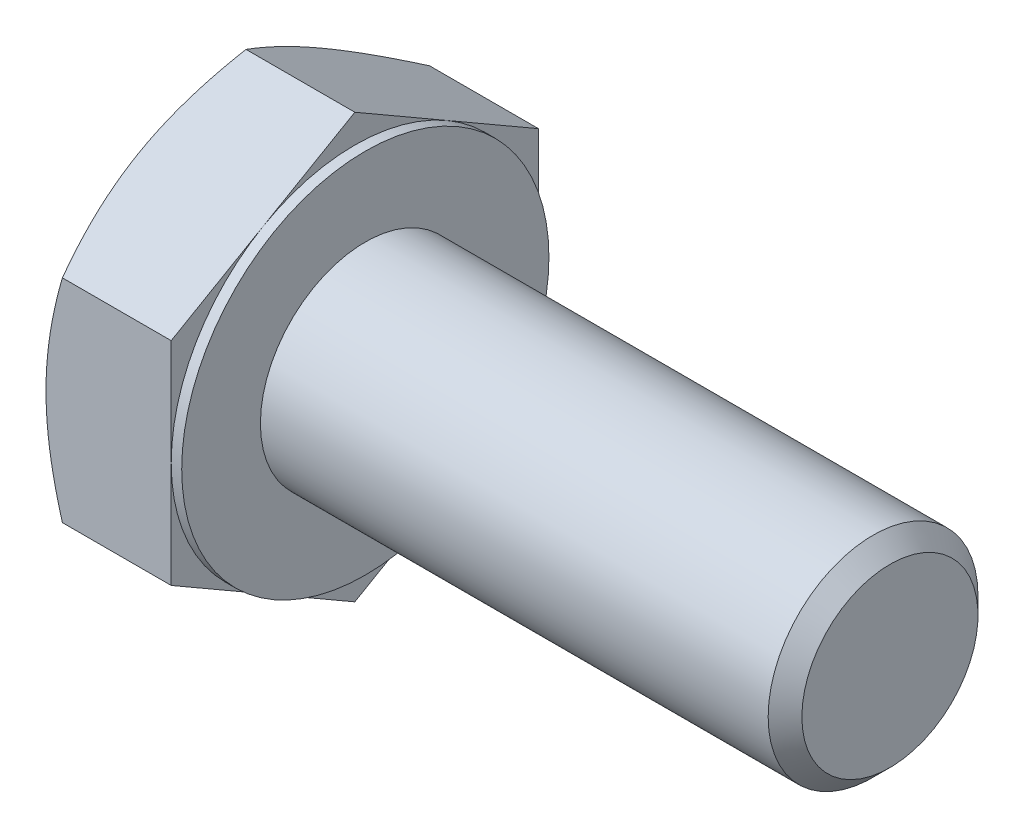
ISO-10303-21;
HEADER;
FILE_DESCRIPTION(('STEP AP214'),'2;1');
FILE_NAME('part.step','',(''),(''),'','','');
FILE_SCHEMA(('AUTOMOTIVE_DESIGN { 1 0 10303 214 1 1 1 1 }'));
ENDSEC;
DATA;
#1=APPLICATION_CONTEXT('core data for automotive mechanical design processes');
#2=APPLICATION_PROTOCOL_DEFINITION('international standard','automotive_design',2000,#1);
#3=PRODUCT_CONTEXT('',#1,'mechanical');
#4=PRODUCT('Part','Part','',(#3));
#5=PRODUCT_RELATED_PRODUCT_CATEGORY('part','',(#4));
#6=PRODUCT_DEFINITION_FORMATION('','',#4);
#7=PRODUCT_DEFINITION_CONTEXT('part definition',#1,'design');
#8=PRODUCT_DEFINITION('design','',#6,#7);
#9=PRODUCT_DEFINITION_SHAPE('','',#8);
#10=(LENGTH_UNIT() NAMED_UNIT(*) SI_UNIT(.MILLI.,.METRE.));
#11=(NAMED_UNIT(*) PLANE_ANGLE_UNIT() SI_UNIT($,.RADIAN.));
#12=(NAMED_UNIT(*) SI_UNIT($,.STERADIAN.) SOLID_ANGLE_UNIT());
#13=UNCERTAINTY_MEASURE_WITH_UNIT(LENGTH_MEASURE(1.E-05),#10,'distance_accuracy_value','');
#14=(GEOMETRIC_REPRESENTATION_CONTEXT(3) GLOBAL_UNCERTAINTY_ASSIGNED_CONTEXT((#13)) GLOBAL_UNIT_ASSIGNED_CONTEXT((#10,
#11,#12)) REPRESENTATION_CONTEXT('',''));
#15=CARTESIAN_POINT('',(0.,0.,0.));
#16=DIRECTION('',(0.,0.,1.));
#17=DIRECTION('',(1.,0.,0.));
#18=AXIS2_PLACEMENT_3D('',#15,#16,#17);
#19=CARTESIAN_POINT('',(7.76,12.1243556529821,0.));
#20=DIRECTION('',(1.,0.,0.));
#21=DIRECTION('',(0.,0.,-1.));
#22=AXIS2_PLACEMENT_3D('',#19,#20,#21);
#23=PLANE('',#22);
#24=CARTESIAN_POINT('',(7.76,0.,0.));
#25=DIRECTION('',(1.,0.,0.));
#26=DIRECTION('',(0.,0.,-1.));
#27=AXIS2_PLACEMENT_3D('',#24,#25,#26);
#28=CIRCLE('',#27,6.);
#29=CARTESIAN_POINT('',(7.76,0.,-6.));
#30=VERTEX_POINT('',#29);
#31=EDGE_CURVE('E289',#30,#30,#28,.F.);
#32=ORIENTED_EDGE('',*,*,#31,.T.);
#33=EDGE_LOOP('',(#32));
#34=FACE_BOUND('',#33,.T.);
#35=CARTESIAN_POINT('',(7.76,0.,0.));
#36=DIRECTION('',(1.,0.,0.));
#37=DIRECTION('',(0.,0.,-1.));
#38=AXIS2_PLACEMENT_3D('',#35,#36,#37);
#39=CIRCLE('',#38,10.5);
#40=CARTESIAN_POINT('',(7.76,0.,-10.5));
#41=VERTEX_POINT('',#40);
#42=EDGE_CURVE('E308',#41,#41,#39,.T.);
#43=ORIENTED_EDGE('',*,*,#42,.T.);
#44=EDGE_LOOP('',(#43));
#45=FACE_BOUND('',#44,.T.);
#46=ADVANCED_FACE('F43',(#34,#45),#23,.T.);
#47=CARTESIAN_POINT('',(0.,0.,0.));
#48=DIRECTION('',(-1.,0.,0.));
#49=DIRECTION('',(0.,0.,1.));
#50=AXIS2_PLACEMENT_3D('',#47,#48,#49);
#51=CYLINDRICAL_SURFACE('',#50,6.);
#52=ORIENTED_EDGE('',*,*,#31,.F.);
#53=EDGE_LOOP('',(#52));
#54=FACE_BOUND('',#53,.T.);
#55=CARTESIAN_POINT('',(36.796,0.,0.));
#56=DIRECTION('',(-1.,0.,0.));
#57=DIRECTION('',(0.,0.,1.));
#58=AXIS2_PLACEMENT_3D('',#55,#56,#57);
#59=CIRCLE('',#58,6.);
#60=CARTESIAN_POINT('',(36.796,0.,6.));
#61=VERTEX_POINT('',#60);
#62=EDGE_CURVE('E286',#61,#61,#59,.T.);
#63=ORIENTED_EDGE('',*,*,#62,.T.);
#64=EDGE_LOOP('',(#63));
#65=FACE_BOUND('',#64,.T.);
#66=ADVANCED_FACE('F258',(#54,#65),#51,.T.);
#67=CARTESIAN_POINT('',(37.76,0.,0.));
#68=DIRECTION('',(-1.,0.,0.));
#69=DIRECTION('',(0.,0.,1.));
#70=AXIS2_PLACEMENT_3D('',#67,#68,#69);
#71=CONICAL_SURFACE('',#70,5.036,0.785398163397442);
#72=ORIENTED_EDGE('',*,*,#62,.F.);
#73=EDGE_LOOP('',(#72));
#74=FACE_BOUND('',#73,.T.);
#75=CARTESIAN_POINT('',(37.76,0.,0.));
#76=DIRECTION('',(-1.,0.,0.));
#77=DIRECTION('',(0.,0.,1.));
#78=AXIS2_PLACEMENT_3D('',#75,#76,#77);
#79=CIRCLE('',#78,5.036);
#80=CARTESIAN_POINT('',(37.76,0.,5.036));
#81=VERTEX_POINT('',#80);
#82=EDGE_CURVE('E284',#81,#81,#79,.T.);
#83=ORIENTED_EDGE('',*,*,#82,.T.);
#84=EDGE_LOOP('',(#83));
#85=FACE_BOUND('',#84,.T.);
#86=ADVANCED_FACE('F265',(#74,#85),#71,.T.);
#87=CARTESIAN_POINT('',(37.76,0.,0.));
#88=DIRECTION('',(-1.,0.,0.));
#89=DIRECTION('',(0.,0.,1.));
#90=AXIS2_PLACEMENT_3D('',#87,#88,#89);
#91=PLANE('',#90);
#92=ORIENTED_EDGE('',*,*,#82,.F.);
#93=EDGE_LOOP('',(#92));
#94=FACE_BOUND('',#93,.T.);
#95=ADVANCED_FACE('F272',(#94),#91,.F.);
#96=CARTESIAN_POINT('',(7.16,10.5,0.));
#97=DIRECTION('',(1.,0.,0.));
#98=DIRECTION('',(0.,0.,-1.));
#99=AXIS2_PLACEMENT_3D('',#96,#97,#98);
#100=PLANE('',#99);
#101=DIRECTION('',(0.,0.500000000000001,0.866025403784438));
#102=VECTOR('',#101,1.);
#103=CARTESIAN_POINT('',(7.16,6.06217782649106,-10.5));
#104=LINE('',#103,#102);
#105=CARTESIAN_POINT('',(7.16,6.06217782649106,-10.5));
#106=VERTEX_POINT('',#105);
#107=CARTESIAN_POINT('',(7.16,9.0932667397366,-5.25000000000001));
#108=VERTEX_POINT('',#107);
#109=EDGE_CURVE('E176',#106,#108,#104,.T.);
#110=ORIENTED_EDGE('',*,*,#109,.T.);
#111=CARTESIAN_POINT('',(7.16,0.,0.));
#112=DIRECTION('',(-1.,0.,0.));
#113=DIRECTION('',(0.,0.,1.));
#114=AXIS2_PLACEMENT_3D('',#111,#112,#113);
#115=CIRCLE('',#114,10.5);
#116=CARTESIAN_POINT('',(7.16,0.,-10.5));
#117=VERTEX_POINT('',#116);
#118=EDGE_CURVE('E59',#108,#117,#115,.T.);
#119=ORIENTED_EDGE('',*,*,#118,.T.);
#120=DIRECTION('',(0.,1.,0.));
#121=VECTOR('',#120,1.);
#122=CARTESIAN_POINT('',(7.16,6.06217782649106,-10.5));
#123=LINE('',#122,#121);
#124=EDGE_CURVE('E48',#117,#106,#123,.T.);
#125=ORIENTED_EDGE('',*,*,#124,.T.);
#126=EDGE_LOOP('',(#110,#119,#125));
#127=FACE_BOUND('',#126,.T.);
#128=ADVANCED_FACE('F275',(#127),#100,.T.);
#129=CARTESIAN_POINT('',(7.16,12.1243556529821,0.));
#130=VERTEX_POINT('',#129);
#131=EDGE_CURVE('E174',#108,#130,#104,.T.);
#132=ORIENTED_EDGE('',*,*,#131,.T.);
#133=DIRECTION('',(0.,-0.500000000000001,0.866025403784438));
#134=VECTOR('',#133,1.);
#135=CARTESIAN_POINT('',(7.16,12.1243556529821,0.));
#136=LINE('',#135,#134);
#137=CARTESIAN_POINT('',(7.16,9.0932667397366,5.25000000000001));
#138=VERTEX_POINT('',#137);
#139=EDGE_CURVE('E173',#130,#138,#136,.T.);
#140=ORIENTED_EDGE('',*,*,#139,.T.);
#141=EDGE_CURVE('E162',#138,#108,#115,.T.);
#142=ORIENTED_EDGE('',*,*,#141,.T.);
#143=EDGE_LOOP('',(#132,#140,#142));
#144=FACE_BOUND('',#143,.T.);
#145=ADVANCED_FACE('F280',(#144),#100,.T.);
#146=CARTESIAN_POINT('',(7.16,6.06217782649106,10.5));
#147=VERTEX_POINT('',#146);
#148=EDGE_CURVE('E141',#138,#147,#136,.T.);
#149=ORIENTED_EDGE('',*,*,#148,.T.);
#150=DIRECTION('',(0.,-1.,0.));
#151=VECTOR('',#150,1.);
#152=CARTESIAN_POINT('',(7.16,6.06217782649106,10.5));
#153=LINE('',#152,#151);
#154=CARTESIAN_POINT('',(7.16,0.,10.5));
#155=VERTEX_POINT('',#154);
#156=EDGE_CURVE('E135',#147,#155,#153,.T.);
#157=ORIENTED_EDGE('',*,*,#156,.T.);
#158=EDGE_CURVE('E139',#155,#138,#115,.T.);
#159=ORIENTED_EDGE('',*,*,#158,.T.);
#160=EDGE_LOOP('',(#149,#157,#159));
#161=FACE_BOUND('',#160,.T.);
#162=ADVANCED_FACE('F137',(#161),#100,.T.);
#163=CARTESIAN_POINT('',(7.16,-6.06217782649105,10.5));
#164=VERTEX_POINT('',#163);
#165=EDGE_CURVE('E145',#155,#164,#153,.T.);
#166=ORIENTED_EDGE('',*,*,#165,.T.);
#167=DIRECTION('',(0.,-0.500000000000002,-0.866025403784438));
#168=VECTOR('',#167,1.);
#169=CARTESIAN_POINT('',(7.16,-12.1243556529822,0.));
#170=LINE('',#169,#168);
#171=CARTESIAN_POINT('',(7.16,-9.09326673973659,5.25000000000002));
#172=VERTEX_POINT('',#171);
#173=EDGE_CURVE('E152',#164,#172,#170,.T.);
#174=ORIENTED_EDGE('',*,*,#173,.T.);
#175=EDGE_CURVE('E149',#172,#155,#115,.T.);
#176=ORIENTED_EDGE('',*,*,#175,.T.);
#177=EDGE_LOOP('',(#166,#174,#176));
#178=FACE_BOUND('',#177,.T.);
#179=ADVANCED_FACE('F150',(#178),#100,.T.);
#180=CARTESIAN_POINT('',(7.16,-12.1243556529822,0.));
#181=VERTEX_POINT('',#180);
#182=EDGE_CURVE('E168',#172,#181,#170,.T.);
#183=ORIENTED_EDGE('',*,*,#182,.T.);
#184=DIRECTION('',(0.,0.5,-0.866025403784439));
#185=VECTOR('',#184,1.);
#186=CARTESIAN_POINT('',(7.16,-6.06217782649108,-10.5));
#187=LINE('',#186,#185);
#188=CARTESIAN_POINT('',(7.16,-9.09326673973661,-5.25));
#189=VERTEX_POINT('',#188);
#190=EDGE_CURVE('E344',#181,#189,#187,.T.);
#191=ORIENTED_EDGE('',*,*,#190,.T.);
#192=EDGE_CURVE('E156',#189,#172,#115,.T.);
#193=ORIENTED_EDGE('',*,*,#192,.T.);
#194=EDGE_LOOP('',(#183,#191,#193));
#195=FACE_BOUND('',#194,.T.);
#196=ADVANCED_FACE('F349',(#195),#100,.T.);
#197=CARTESIAN_POINT('',(7.16,-6.06217782649108,-10.5));
#198=VERTEX_POINT('',#197);
#199=EDGE_CURVE('E163',#189,#198,#187,.T.);
#200=ORIENTED_EDGE('',*,*,#199,.T.);
#201=EDGE_CURVE('E11',#198,#117,#123,.T.);
#202=ORIENTED_EDGE('',*,*,#201,.T.);
#203=EDGE_CURVE('E362',#117,#189,#115,.T.);
#204=ORIENTED_EDGE('',*,*,#203,.T.);
#205=EDGE_LOOP('',(#200,#202,#204));
#206=FACE_BOUND('',#205,.T.);
#207=ADVANCED_FACE('F281',(#206),#100,.T.);
#208=CARTESIAN_POINT('',(0.,0.,0.));
#209=DIRECTION('',(-1.,0.,0.));
#210=DIRECTION('',(0.,0.,1.));
#211=AXIS2_PLACEMENT_3D('',#208,#209,#210);
#212=CYLINDRICAL_SURFACE('',#211,10.5);
#213=ORIENTED_EDGE('',*,*,#118,.F.);
#214=ORIENTED_EDGE('',*,*,#141,.F.);
#215=ORIENTED_EDGE('',*,*,#158,.F.);
#216=ORIENTED_EDGE('',*,*,#175,.F.);
#217=ORIENTED_EDGE('',*,*,#192,.F.);
#218=ORIENTED_EDGE('',*,*,#203,.F.);
#219=EDGE_LOOP('',(#213,#214,#215,#216,#217,#218));
#220=FACE_BOUND('',#219,.T.);
#221=ORIENTED_EDGE('',*,*,#42,.F.);
#222=EDGE_LOOP('',(#221));
#223=FACE_BOUND('',#222,.T.);
#224=ADVANCED_FACE('F159',(#220,#223),#212,.T.);
#225=CARTESIAN_POINT('',(0.,12.1243556529821,0.));
#226=DIRECTION('',(1.,0.,0.));
#227=DIRECTION('',(0.,0.,-1.));
#228=AXIS2_PLACEMENT_3D('',#225,#226,#227);
#229=PLANE('',#228);
#230=CARTESIAN_POINT('',(0.,0.,0.));
#231=DIRECTION('',(1.,0.,0.));
#232=DIRECTION('',(0.,0.,-1.));
#233=AXIS2_PLACEMENT_3D('',#230,#231,#232);
#234=CIRCLE('',#233,10.5);
#235=CARTESIAN_POINT('',(0.,0.,-10.5));
#236=VERTEX_POINT('',#235);
#237=CARTESIAN_POINT('',(0.,9.0932667397366,-5.25000000000001));
#238=VERTEX_POINT('',#237);
#239=EDGE_CURVE('E307',#236,#238,#234,.T.);
#240=ORIENTED_EDGE('',*,*,#239,.F.);
#241=CARTESIAN_POINT('',(0.,-9.09326673973661,-5.25));
#242=VERTEX_POINT('',#241);
#243=EDGE_CURVE('E304',#242,#236,#234,.T.);
#244=ORIENTED_EDGE('',*,*,#243,.F.);
#245=CARTESIAN_POINT('',(0.,-9.09326673973659,5.25000000000002));
#246=VERTEX_POINT('',#245);
#247=EDGE_CURVE('E306',#246,#242,#234,.T.);
#248=ORIENTED_EDGE('',*,*,#247,.F.);
#249=CARTESIAN_POINT('',(0.,0.,10.5));
#250=VERTEX_POINT('',#249);
#251=EDGE_CURVE('E316',#250,#246,#234,.T.);
#252=ORIENTED_EDGE('',*,*,#251,.F.);
#253=CARTESIAN_POINT('',(0.,0.,0.));
#254=DIRECTION('',(-1.,0.,0.));
#255=DIRECTION('',(0.,0.,1.));
#256=AXIS2_PLACEMENT_3D('',#253,#254,#255);
#257=CIRCLE('',#256,10.5);
#258=CARTESIAN_POINT('',(0.,9.0932667397366,5.25000000000001));
#259=VERTEX_POINT('',#258);
#260=EDGE_CURVE('E177',#250,#259,#257,.T.);
#261=ORIENTED_EDGE('',*,*,#260,.T.);
#262=EDGE_CURVE('E311',#238,#259,#234,.T.);
#263=ORIENTED_EDGE('',*,*,#262,.F.);
#264=EDGE_LOOP('',(#240,#244,#248,#252,#261,#263));
#265=FACE_BOUND('',#264,.T.);
#266=ADVANCED_FACE('F208',(#265),#229,.F.);
#267=CARTESIAN_POINT('',(0.,0.,0.));
#268=DIRECTION('',(1.,0.,0.));
#269=DIRECTION('',(0.,0.,-1.));
#270=AXIS2_PLACEMENT_3D('',#267,#268,#269);
#271=CONICAL_SURFACE('',#270,10.5,1.0471975511966);
#272=CARTESIAN_POINT('',(0.93788884112796,6.06206235643723,10.5002));
#273=CARTESIAN_POINT('',(0.860963916074866,6.19532217726989,10.2693872197103));
#274=CARTESIAN_POINT('',(0.787530383052678,6.32907886020533,10.0377138490142));
#275=CARTESIAN_POINT('',(0.648614855969203,6.5976648546052,9.57250926051226));
#276=CARTESIAN_POINT('',(0.583135477152653,6.73249450340811,9.33897745841895));
#277=CARTESIAN_POINT('',(0.399895760205336,7.13915595713548,8.63461915908332));
#278=CARTESIAN_POINT('',(0.295669956057557,7.41259311049437,8.16101211678873));
#279=CARTESIAN_POINT('',(0.173455649415435,7.82177929100534,7.45228086238868));
#280=CARTESIAN_POINT('',(0.138641420005216,7.95630585259384,7.21927402274984));
#281=CARTESIAN_POINT('',(0.0802602632087865,8.22598182110483,6.75218154370847));
#282=CARTESIAN_POINT('',(0.056693552302522,8.36113123996485,6.51809588362951));
#283=CARTESIAN_POINT('',(0.0214112687997644,8.63165551188221,6.04953409998806));
#284=CARTESIAN_POINT('',(0.0096816130697718,8.76702990465438,5.81505877366288));
#285=CARTESIAN_POINT('',(-0.00167731742386591,9.03790372875115,5.3458915478868));
#286=CARTESIAN_POINT('',(-0.0013069660501828,9.17340315608311,5.11119965535135));
#287=CARTESIAN_POINT('',(0.0106922674925487,9.42672188157244,4.67243875229525));
#288=CARTESIAN_POINT('',(0.0208573916341302,9.54455906045898,4.46833877144319));
#289=CARTESIAN_POINT('',(0.0501416022118153,9.77995782117302,4.06061615784772));
#290=CARTESIAN_POINT('',(0.069261322025491,9.89751938291429,3.85699355989469));
#291=CARTESIAN_POINT('',(0.139600342172598,10.2497485423003,3.24691475993086));
#292=CARTESIAN_POINT('',(0.203790739708334,10.4837926714473,2.84153843703495));
#293=CARTESIAN_POINT('',(0.364267089688405,10.9543635439239,2.02648577734362));
#294=CARTESIAN_POINT('',(0.461233267874625,11.1908302333322,1.61691345699068));
#295=CARTESIAN_POINT('',(0.681306134882001,11.6602373627233,0.803876459450408));
#296=CARTESIAN_POINT('',(0.804361137283494,11.8931838134373,0.400401371370838));
#297=CARTESIAN_POINT('',(0.937888841127967,12.124471123036,-0.000200000000000229));
#298=B_SPLINE_CURVE_WITH_KNOTS('',3,(#272,#273,#274,#275,#276,#277,#278,#279,#280,#281,#282,
#283,#284,#285,#286,#287,#288,#289,#290,#291,#292,#293,#294,#295,#296,#297),.UNSPECIFIED.,.F.,
.F.,(4,2,2,2,2,2,2,2,2,2,2,2,4),(0.,0.832130250860041,1.66453336135423,3.33288308532808,
4.14658222524688,4.9602970257261,5.77304256378742,6.58576298988571,7.29326708484993,
8.00082123064117,9.41693497455991,10.864454487818,12.3091325775355),.UNSPECIFIED.);
#299=CARTESIAN_POINT('',(0.937822173508928,12.1243556529821,0.));
#300=VERTEX_POINT('',#299);
#301=EDGE_CURVE('E227',#259,#300,#298,.T.);
#302=ORIENTED_EDGE('',*,*,#301,.T.);
#303=CARTESIAN_POINT('',(0.937888841127967,12.124471123036,0.0002));
#304=CARTESIAN_POINT('',(0.860963916074872,11.9912113022033,-0.230612780289705));
#305=CARTESIAN_POINT('',(0.787530383052684,11.8574546192679,-0.462286150985754));
#306=CARTESIAN_POINT('',(0.648614855969208,11.588868624868,-0.927490739487739));
#307=CARTESIAN_POINT('',(0.583135477152658,11.4540389760651,-1.16102254158105));
#308=CARTESIAN_POINT('',(0.39989576020534,11.0473775223377,-1.86538084091668));
#309=CARTESIAN_POINT('',(0.295669956057561,10.7739403689788,-2.33898788321127));
#310=CARTESIAN_POINT('',(0.173455649415438,10.3647541884679,-3.04771913761133));
#311=CARTESIAN_POINT('',(0.138641420005218,10.2302276268794,-3.28072597725016));
#312=CARTESIAN_POINT('',(0.0802602632087872,9.96055165836838,-3.74781845629153));
#313=CARTESIAN_POINT('',(0.0566935523025218,9.82540223950836,-3.98190411637049));
#314=CARTESIAN_POINT('',(0.0214112687997641,9.554877967591,-4.45046590001194));
#315=CARTESIAN_POINT('',(0.00968161306977229,9.41950357481883,-4.68494122633712));
#316=CARTESIAN_POINT('',(-0.0016773174238659,9.14862975072206,-5.1541084521132));
#317=CARTESIAN_POINT('',(-0.00130696605018409,9.01313032339009,-5.38880034464865));
#318=CARTESIAN_POINT('',(0.010692267492547,8.75981159790077,-5.82756124770475));
#319=CARTESIAN_POINT('',(0.0208573916341292,8.64197441901423,-6.03166122855681));
#320=CARTESIAN_POINT('',(0.0501416022118143,8.40657565830019,-6.43938384215229));
#321=CARTESIAN_POINT('',(0.0692613220254892,8.28901409655892,-6.64300644010532));
#322=CARTESIAN_POINT('',(0.139600342172594,7.93678493717292,-7.25308524006914));
#323=CARTESIAN_POINT('',(0.20379073970833,7.70274080802586,-7.65846156296505));
#324=CARTESIAN_POINT('',(0.3642670896884,7.23216993554935,-8.47351422265637));
#325=CARTESIAN_POINT('',(0.461233267874619,6.99570324614096,-8.88308654300932));
#326=CARTESIAN_POINT('',(0.681306134881994,6.52629611674996,-9.69612354054959));
#327=CARTESIAN_POINT('',(0.804361137283486,6.29334966603591,-10.0995986286292));
#328=CARTESIAN_POINT('',(0.937888841127958,6.06206235643722,-10.5002));
#329=B_SPLINE_CURVE_WITH_KNOTS('',3,(#303,#304,#305,#306,#307,#308,#309,#310,#311,#312,#313,
#314,#315,#316,#317,#318,#319,#320,#321,#322,#323,#324,#325,#326,#327,#328),.UNSPECIFIED.,.F.,
.F.,(4,2,2,2,2,2,2,2,2,2,2,2,4),(0.,0.83213025086004,1.66453336135423,3.33288308532808,
4.14658222524689,4.96029702572611,5.77304256378742,6.58576298988572,7.29326708484994,
8.00082123064117,9.41693497455992,10.864454487818,12.3091325775355),.UNSPECIFIED.);
#330=EDGE_CURVE('E67',#300,#238,#329,.T.);
#331=ORIENTED_EDGE('',*,*,#330,.T.);
#332=ORIENTED_EDGE('',*,*,#262,.T.);
#333=EDGE_LOOP('',(#302,#331,#332));
#334=FACE_BOUND('',#333,.T.);
#335=ADVANCED_FACE('F358',(#334),#271,.T.);
#336=CARTESIAN_POINT('',(5.22047445997536,-16.4816482140568,10.5));
#337=CARTESIAN_POINT('',(5.10841571171519,-16.2515114735598,10.5));
#338=CARTESIAN_POINT('',(4.99690095530743,-16.0211099745561,10.5));
#339=CARTESIAN_POINT('',(4.77508224781972,-15.559722280235,10.5));
#340=CARTESIAN_POINT('',(4.6647783083252,-15.3287360793489,10.5));
#341=CARTESIAN_POINT('',(4.33583913312079,-14.6347588203258,10.5));
#342=CARTESIAN_POINT('',(4.11920831465378,-14.1708141864105,10.5));
#343=CARTESIAN_POINT('',(3.69144021647067,-13.2374542365562,10.5));
#344=CARTESIAN_POINT('',(3.4803375958213,-12.768022998992,10.5));
#345=CARTESIAN_POINT('',(3.06650722260727,-11.8254960891314,10.5));
#346=CARTESIAN_POINT('',(2.86377908729971,-11.3524005854809,10.5));
#347=CARTESIAN_POINT('',(2.46224554950905,-10.3857558923946,10.5));
#348=CARTESIAN_POINT('',(2.26380321740469,-9.89205511876752,10.5));
#349=CARTESIAN_POINT('',(1.8814629725383,-8.89894764184035,10.5));
#350=CARTESIAN_POINT('',(1.69756666425613,-8.39954031602049,10.5));
#351=CARTESIAN_POINT('',(1.34900485222961,-7.39511365326185,10.5));
#352=CARTESIAN_POINT('',(1.18430206101262,-6.89010735786107,10.5));
#353=CARTESIAN_POINT('',(0.879270894971035,-5.87280589755246,10.5));
#354=CARTESIAN_POINT('',(0.738935048658887,-5.36051301919645,10.5));
#355=CARTESIAN_POINT('',(0.552073744608598,-4.58793726300858,10.5));
#356=CARTESIAN_POINT('',(0.493860241162087,-4.33046551050763,10.5));
#357=CARTESIAN_POINT('',(0.385986916267515,-3.81372703405903,10.5));
#358=CARTESIAN_POINT('',(0.336326929050835,-3.55446034499886,10.5));
#359=CARTESIAN_POINT('',(0.246424565907479,-3.03429646607579,10.5));
#360=CARTESIAN_POINT('',(0.206181997423116,-2.77339930966301,10.5));
#361=CARTESIAN_POINT('',(0.135909252260438,-2.25023434858904,10.5));
#362=CARTESIAN_POINT('',(0.10587866333212,-1.98796659969175,10.5));
#363=CARTESIAN_POINT('',(0.0570143132377883,-1.46593685398522,10.5));
#364=CARTESIAN_POINT('',(0.0380355913859207,-1.20618851046129,10.5));
#365=CARTESIAN_POINT('',(0.011088652904134,-0.686121830920416,10.5));
#366=CARTESIAN_POINT('',(0.00312024799755506,-0.425803504726439,10.5));
#367=CARTESIAN_POINT('',(-0.00161548269340229,0.0949369886887055,10.5));
#368=CARTESIAN_POINT('',(0.0016171740722833,0.355359155747468,10.5));
#369=CARTESIAN_POINT('',(0.0192021822582614,0.87583052258273,10.5));
#370=CARTESIAN_POINT('',(0.0335550415989468,1.1358797047794,10.5));
#371=CARTESIAN_POINT('',(0.0806524760626045,1.75496707583262,10.5));
#372=CARTESIAN_POINT('',(0.118345532369852,2.1136373118209,10.5));
#373=CARTESIAN_POINT('',(0.212873234930084,2.8284272831381,10.5));
#374=CARTESIAN_POINT('',(0.269710320924681,3.18454668747495,10.5));
#375=CARTESIAN_POINT('',(0.465933295546488,4.24861014214034,10.5));
#376=CARTESIAN_POINT('',(0.630998761834299,4.95188760375778,10.5));
#377=CARTESIAN_POINT('',(0.918660194089468,6.00372345480016,10.5));
#378=CARTESIAN_POINT('',(1.02259898965263,6.35769943645641,10.5));
#379=CARTESIAN_POINT('',(1.24163072977518,7.06221736873326,10.5));
#380=CARTESIAN_POINT('',(1.35672375176118,7.41275929549788,10.5));
#381=CARTESIAN_POINT('',(1.59618779282069,8.11051221625826,10.5));
#382=CARTESIAN_POINT('',(1.72055601508113,8.45772417900516,10.5));
#383=CARTESIAN_POINT('',(1.97707156080398,9.14924773243467,10.5));
#384=CARTESIAN_POINT('',(2.10921876866479,9.49355936613148,10.5));
#385=CARTESIAN_POINT('',(2.44296998759923,10.3391184043911,10.5));
#386=CARTESIAN_POINT('',(2.64829832241361,10.8388935045485,10.5));
#387=CARTESIAN_POINT('',(3.06975629526236,11.8338834048329,10.5));
#388=CARTESIAN_POINT('',(3.28588675525598,12.3290978545235,10.5));
#389=CARTESIAN_POINT('',(3.72667156109685,13.3158710243329,10.5));
#390=CARTESIAN_POINT('',(3.95132823824253,13.8074287000047,10.5));
#391=CARTESIAN_POINT('',(4.40735039707026,14.787397422387,10.5));
#392=CARTESIAN_POINT('',(4.63871569859714,15.275808553166,10.5));
#393=CARTESIAN_POINT('',(5.10713604015688,16.2506551575346,10.5));
#394=CARTESIAN_POINT('',(5.34419794777524,16.7370873249548,10.5));
#395=CARTESIAN_POINT('',(5.82271335290612,17.7077867337536,10.5));
#396=CARTESIAN_POINT('',(6.06416687416916,18.1920539634064,10.5));
#397=CARTESIAN_POINT('',(6.55064006057609,19.1586956492924,10.5));
#398=CARTESIAN_POINT('',(6.79565915421552,19.6410703934622,10.5));
#399=CARTESIAN_POINT('',(7.28869163212712,20.6042880925481,10.5));
#400=CARTESIAN_POINT('',(7.53670502871591,21.0851310411532,10.5));
#401=CARTESIAN_POINT('',(8.23932373085847,22.4387066917319,10.5));
#402=CARTESIAN_POINT('',(8.69680932414608,23.309944158655,10.5));
#403=CARTESIAN_POINT('',(9.61789414324542,25.0492220911548,10.5));
#404=CARTESIAN_POINT('',(10.0814936344989,25.9172624158169,10.5));
#405=CARTESIAN_POINT('',(11.0120158407316,27.6483953506379,10.5));
#406=CARTESIAN_POINT('',(11.4789254491471,28.5114950107132,10.5));
#407=CARTESIAN_POINT('',(12.1819662737832,29.8046526006514,10.5));
#408=CARTESIAN_POINT('',(12.4167519504062,30.2354431241637,10.5));
#409=CARTESIAN_POINT('',(12.8871248069562,31.0965855728269,10.5));
#410=CARTESIAN_POINT('',(13.1227119856788,31.5269374986354,10.5));
#411=CARTESIAN_POINT('',(13.3586525810193,31.9570956307335,10.5));
#412=B_SPLINE_CURVE_WITH_KNOTS('',3,(#336,#337,#338,#339,#340,#341,#342,#343,#344,#345,#346,
#347,#348,#349,#350,#351,#352,#353,#354,#355,#356,#357,#358,#359,#360,#361,#362,#363,#364,#365,
#366,#367,#368,#369,#370,#371,#372,#373,#374,#375,#376,#377,#378,#379,#380,#381,#382,#383,#384,
#385,#386,#387,#388,#389,#390,#391,#392,#393,#394,#395,#396,#397,#398,#399,#400,#401,#402,#403,
#404,#405,#406,#407,#408,#409,#410,#411),.UNSPECIFIED.,.F.,.F.,(4,2,2,2,2,2,2,2,2,2,2,2,2,2,2,2,
2,2,2,2,2,2,2,2,2,2,2,2,2,2,2,2,2,2,2,2,2,4),(0.,0.767905398539751,1.53581813821281,
3.07186087436344,4.61593758475197,6.15994364725085,7.75603870055618,9.35230956420839,
10.9454257273475,12.5380525370423,13.3298454796426,14.1216230754322,14.9133844803533,
15.7051139186612,16.4862101446219,17.2672930136548,18.048374665853,18.8294919964201,
19.9108211856413,20.9922882331231,23.1563369158225,24.2630005252896,25.3696718171689,
26.4760107458873,27.5823332377206,29.2030865736282,30.8239634248119,32.4452867065055,
34.0665664890081,35.6899099962019,37.3132622852947,38.9363571817833,40.559458756917,
43.5115615357815,46.4637929082396,49.4076749676358,50.8795245740058,52.3513719698337),.UNSPECIFIED.);
#413=CARTESIAN_POINT('',(0.937822173508921,6.06217782649106,10.5));
#414=VERTEX_POINT('',#413);
#415=EDGE_CURVE('E241',#250,#414,#412,.T.);
#416=ORIENTED_EDGE('',*,*,#415,.T.);
#417=EDGE_CURVE('E240',#414,#259,#298,.T.);
#418=ORIENTED_EDGE('',*,*,#417,.T.);
#419=ORIENTED_EDGE('',*,*,#260,.F.);
#420=EDGE_LOOP('',(#416,#418,#419));
#421=FACE_BOUND('',#420,.T.);
#422=ADVANCED_FACE('F354',(#421),#271,.T.);
#423=CARTESIAN_POINT('',(0.937822173508918,-6.06217782649105,10.5));
#424=VERTEX_POINT('',#423);
#425=EDGE_CURVE('E287',#424,#250,#412,.T.);
#426=ORIENTED_EDGE('',*,*,#425,.T.);
#427=ORIENTED_EDGE('',*,*,#251,.T.);
#428=CARTESIAN_POINT('',(0.937888841127968,-12.124471123036,-0.000200000000000038));
#429=CARTESIAN_POINT('',(0.860963916074874,-11.9912113022033,0.230612780289706));
#430=CARTESIAN_POINT('',(0.787530383052686,-11.8574546192679,0.462286150985755));
#431=CARTESIAN_POINT('',(0.64861485596921,-11.588868624868,0.92749073948774));
#432=CARTESIAN_POINT('',(0.583135477152659,-11.4540389760651,1.16102254158105));
#433=CARTESIAN_POINT('',(0.39989576020534,-11.0473775223377,1.86538084091668));
#434=CARTESIAN_POINT('',(0.295669956057561,-10.7739403689788,2.33898788321127));
#435=CARTESIAN_POINT('',(0.173455649415437,-10.3647541884679,3.04771913761132));
#436=CARTESIAN_POINT('',(0.138641420005218,-10.2302276268794,3.28072597725016));
#437=CARTESIAN_POINT('',(0.0802602632087865,-9.96055165836838,3.74781845629153));
#438=CARTESIAN_POINT('',(0.0566935523025207,-9.82540223950836,3.98190411637049));
#439=CARTESIAN_POINT('',(0.0214112687997622,-9.554877967591,4.45046590001194));
#440=CARTESIAN_POINT('',(0.00968161306977019,-9.41950357481883,4.68494122633712));
#441=CARTESIAN_POINT('',(-0.0016773174238678,-9.14862975072205,5.1541084521132));
#442=CARTESIAN_POINT('',(-0.00130696605018556,-9.01313032339009,5.38880034464865));
#443=CARTESIAN_POINT('',(0.010692267492545,-8.75981159790077,5.82756124770475));
#444=CARTESIAN_POINT('',(0.0208573916341264,-8.64197441901423,6.03166122855681));
#445=CARTESIAN_POINT('',(0.0501416022118111,-8.40657565830018,6.43938384215228));
#446=CARTESIAN_POINT('',(0.0692613220254864,-8.28901409655891,6.64300644010531));
#447=CARTESIAN_POINT('',(0.139600342172592,-7.93678493717291,7.25308524006914));
#448=CARTESIAN_POINT('',(0.203790739708327,-7.70274080802586,7.65846156296505));
#449=CARTESIAN_POINT('',(0.364267089688396,-7.23216993554935,8.47351422265637));
#450=CARTESIAN_POINT('',(0.461233267874616,-6.99570324614095,8.88308654300932));
#451=CARTESIAN_POINT('',(0.681306134881991,-6.52629611674995,9.69612354054959));
#452=CARTESIAN_POINT('',(0.804361137283484,-6.2933496660359,10.0995986286292));
#453=CARTESIAN_POINT('',(0.937888841127957,-6.06206235643721,10.5002));
#454=B_SPLINE_CURVE_WITH_KNOTS('',3,(#428,#429,#430,#431,#432,#433,#434,#435,#436,#437,#438,
#439,#440,#441,#442,#443,#444,#445,#446,#447,#448,#449,#450,#451,#452,#453),.UNSPECIFIED.,.F.,
.F.,(4,2,2,2,2,2,2,2,2,2,2,2,4),(0.,0.832130250860041,1.66453336135423,3.33288308532808,
4.14658222524689,4.9602970257261,5.77304256378742,6.58576298988572,7.29326708484994,
8.00082123064117,9.41693497455992,10.864454487818,12.3091325775355),.UNSPECIFIED.);
#455=EDGE_CURVE('E229',#246,#424,#454,.T.);
#456=ORIENTED_EDGE('',*,*,#455,.T.);
#457=EDGE_LOOP('',(#426,#427,#456));
#458=FACE_BOUND('',#457,.T.);
#459=ADVANCED_FACE('F197',(#458),#271,.T.);
#460=CARTESIAN_POINT('',(0.937822173508929,-12.1243556529822,0.));
#461=VERTEX_POINT('',#460);
#462=EDGE_CURVE('E221',#461,#246,#454,.T.);
#463=ORIENTED_EDGE('',*,*,#462,.T.);
#464=ORIENTED_EDGE('',*,*,#247,.T.);
#465=CARTESIAN_POINT('',(0.937888841127967,-6.06206235643724,-10.5002));
#466=CARTESIAN_POINT('',(0.860963916074872,-6.19532217726991,-10.2693872197103));
#467=CARTESIAN_POINT('',(0.787530383052684,-6.32907886020534,-10.0377138490142));
#468=CARTESIAN_POINT('',(0.648614855969209,-6.59766485460521,-9.57250926051226));
#469=CARTESIAN_POINT('',(0.583135477152659,-6.73249450340812,-9.33897745841895));
#470=CARTESIAN_POINT('',(0.399895760205342,-7.1391559571355,-8.63461915908332));
#471=CARTESIAN_POINT('',(0.295669956057563,-7.41259311049439,-8.16101211678872));
#472=CARTESIAN_POINT('',(0.173455649415441,-7.82177929100536,-7.45228086238867));
#473=CARTESIAN_POINT('',(0.138641420005222,-7.95630585259386,-7.21927402274984));
#474=CARTESIAN_POINT('',(0.0802602632087921,-8.22598182110485,-6.75218154370847));
#475=CARTESIAN_POINT('',(0.056693552302527,-8.36113123996486,-6.51809588362951));
#476=CARTESIAN_POINT('',(0.0214112687997694,-8.63165551188223,-6.04953409998806));
#477=CARTESIAN_POINT('',(0.00968161306977739,-8.76702990465439,-5.81505877366288));
#478=CARTESIAN_POINT('',(-0.00167731742385998,-9.03790372875117,-5.34589154788679));
#479=CARTESIAN_POINT('',(-0.0013069660501771,-9.17340315608313,-5.11119965535135));
#480=CARTESIAN_POINT('',(0.0106922674925545,-9.42672188157245,-4.67243875229525));
#481=CARTESIAN_POINT('',(0.0208573916341363,-9.54455906045899,-4.46833877144318));
#482=CARTESIAN_POINT('',(0.0501416022118212,-9.77995782117303,-4.06061615784771));
#483=CARTESIAN_POINT('',(0.0692613220254963,-9.89751938291431,-3.85699355989468));
#484=CARTESIAN_POINT('',(0.139600342172602,-10.2497485423003,-3.24691475993085));
#485=CARTESIAN_POINT('',(0.203790739708338,-10.4837926714474,-2.84153843703495));
#486=CARTESIAN_POINT('',(0.364267089688409,-10.9543635439239,-2.02648577734362));
#487=CARTESIAN_POINT('',(0.461233267874629,-11.1908302333323,-1.61691345699068));
#488=CARTESIAN_POINT('',(0.681306134882004,-11.6602373627233,-0.803876459450407));
#489=CARTESIAN_POINT('',(0.804361137283496,-11.8931838134373,-0.400401371370839));
#490=CARTESIAN_POINT('',(0.937888841127968,-12.124471123036,0.000199999999998981));
#491=B_SPLINE_CURVE_WITH_KNOTS('',3,(#465,#466,#467,#468,#469,#470,#471,#472,#473,#474,#475,
#476,#477,#478,#479,#480,#481,#482,#483,#484,#485,#486,#487,#488,#489,#490),.UNSPECIFIED.,.F.,
.F.,(4,2,2,2,2,2,2,2,2,2,2,2,4),(0.,0.832130250860042,1.66453336135423,3.33288308532808,
4.14658222524689,4.96029702572611,5.77304256378742,6.58576298988572,7.29326708484994,
8.00082123064117,9.41693497455991,10.864454487818,12.3091325775355),.UNSPECIFIED.);
#492=EDGE_CURVE('E228',#242,#461,#491,.T.);
#493=ORIENTED_EDGE('',*,*,#492,.T.);
#494=EDGE_LOOP('',(#463,#464,#493));
#495=FACE_BOUND('',#494,.T.);
#496=ADVANCED_FACE('F325',(#495),#271,.T.);
#497=CARTESIAN_POINT('',(0.937822173508921,6.06217782649106,-10.5));
#498=VERTEX_POINT('',#497);
#499=EDGE_CURVE('E230',#238,#498,#329,.T.);
#500=ORIENTED_EDGE('',*,*,#499,.T.);
#501=CARTESIAN_POINT('',(5.22047445997538,-16.4816482140568,-10.5));
#502=CARTESIAN_POINT('',(5.10841571171521,-16.2515114735599,-10.5));
#503=CARTESIAN_POINT('',(4.99690095530745,-16.0211099745562,-10.5));
#504=CARTESIAN_POINT('',(4.77508224781974,-15.559722280235,-10.5));
#505=CARTESIAN_POINT('',(4.66477830832522,-15.3287360793489,-10.5));
#506=CARTESIAN_POINT('',(4.33583913312081,-14.6347588203258,-10.5));
#507=CARTESIAN_POINT('',(4.1192083146538,-14.1708141864106,-10.5));
#508=CARTESIAN_POINT('',(3.69144021647068,-13.2374542365562,-10.5));
#509=CARTESIAN_POINT('',(3.48033759582132,-12.768022998992,-10.5));
#510=CARTESIAN_POINT('',(3.06650722260728,-11.8254960891315,-10.5));
#511=CARTESIAN_POINT('',(2.86377908729973,-11.3524005854809,-10.5));
#512=CARTESIAN_POINT('',(2.46224554950906,-10.3857558923946,-10.5));
#513=CARTESIAN_POINT('',(2.2638032174047,-9.89205511876755,-10.5));
#514=CARTESIAN_POINT('',(1.88146297253831,-8.89894764184038,-10.5));
#515=CARTESIAN_POINT('',(1.69756666425614,-8.39954031602052,-10.5));
#516=CARTESIAN_POINT('',(1.34900485222962,-7.39511365326189,-10.5));
#517=CARTESIAN_POINT('',(1.18430206101263,-6.8901073578611,-10.5));
#518=CARTESIAN_POINT('',(0.879270894971045,-5.87280589755249,-10.5));
#519=CARTESIAN_POINT('',(0.738935048658896,-5.36051301919648,-10.5));
#520=CARTESIAN_POINT('',(0.552073744608606,-4.58793726300861,-10.5));
#521=CARTESIAN_POINT('',(0.493860241162095,-4.33046551050766,-10.5));
#522=CARTESIAN_POINT('',(0.385986916267522,-3.81372703405905,-10.5));
#523=CARTESIAN_POINT('',(0.33632692905084,-3.55446034499889,-10.5));
#524=CARTESIAN_POINT('',(0.246424565907484,-3.03429646607582,-10.5));
#525=CARTESIAN_POINT('',(0.20618199742312,-2.77339930966304,-10.5));
#526=CARTESIAN_POINT('',(0.135909252260442,-2.25023434858907,-10.5));
#527=CARTESIAN_POINT('',(0.105878663332124,-1.98796659969178,-10.5));
#528=CARTESIAN_POINT('',(0.0570143132377921,-1.46593685398525,-10.5));
#529=CARTESIAN_POINT('',(0.0380355913859243,-1.20618851046132,-10.5));
#530=CARTESIAN_POINT('',(0.0110886529041364,-0.686121830920443,-10.5));
#531=CARTESIAN_POINT('',(0.00312024799755661,-0.425803504726465,-10.5));
#532=CARTESIAN_POINT('',(-0.00161548269340184,0.0949369886886809,-10.5));
#533=CARTESIAN_POINT('',(0.00161717407228357,0.355359155747445,-10.5));
#534=CARTESIAN_POINT('',(0.0192021822582611,0.875830522582707,-10.5));
#535=CARTESIAN_POINT('',(0.033555041598946,1.13587970477938,-10.5));
#536=CARTESIAN_POINT('',(0.0806524760626031,1.7549670758326,-10.5));
#537=CARTESIAN_POINT('',(0.118345532369851,2.11363731182088,-10.5));
#538=CARTESIAN_POINT('',(0.212873234930081,2.82842728313808,-10.5));
#539=CARTESIAN_POINT('',(0.269710320924678,3.18454668747492,-10.5));
#540=CARTESIAN_POINT('',(0.465933295546482,4.24861014214031,-10.5));
#541=CARTESIAN_POINT('',(0.630998761834291,4.95188760375775,-10.5));
#542=CARTESIAN_POINT('',(0.918660194089459,6.00372345480012,-10.5));
#543=CARTESIAN_POINT('',(1.02259898965262,6.35769943645638,-10.5));
#544=CARTESIAN_POINT('',(1.24163072977516,7.06221736873322,-10.5));
#545=CARTESIAN_POINT('',(1.35672375176116,7.41275929549785,-10.5));
#546=CARTESIAN_POINT('',(1.59618779282068,8.11051221625822,-10.5));
#547=CARTESIAN_POINT('',(1.72055601508111,8.45772417900512,-10.5));
#548=CARTESIAN_POINT('',(1.97707156080397,9.14924773243463,-10.5));
#549=CARTESIAN_POINT('',(2.10921876866478,9.49355936613144,-10.5));
#550=CARTESIAN_POINT('',(2.44296998759922,10.3391184043911,-10.5));
#551=CARTESIAN_POINT('',(2.6482983224136,10.8388935045485,-10.5));
#552=CARTESIAN_POINT('',(3.06975629526234,11.8338834048329,-10.5));
#553=CARTESIAN_POINT('',(3.28588675525597,12.3290978545235,-10.5));
#554=CARTESIAN_POINT('',(3.72667156109684,13.3158710243328,-10.5));
#555=CARTESIAN_POINT('',(3.95132823824252,13.8074287000046,-10.5));
#556=CARTESIAN_POINT('',(4.40735039707024,14.787397422387,-10.5));
#557=CARTESIAN_POINT('',(4.63871569859713,15.275808553166,-10.5));
#558=CARTESIAN_POINT('',(5.10713604015687,16.2506551575346,-10.5));
#559=CARTESIAN_POINT('',(5.34419794777523,16.7370873249547,-10.5));
#560=CARTESIAN_POINT('',(5.82271335290611,17.7077867337536,-10.5));
#561=CARTESIAN_POINT('',(6.06416687416915,18.1920539634064,-10.5));
#562=CARTESIAN_POINT('',(6.55064006057607,19.1586956492924,-10.5));
#563=CARTESIAN_POINT('',(6.79565915421551,19.6410703934622,-10.5));
#564=CARTESIAN_POINT('',(7.28869163212711,20.6042880925481,-10.5));
#565=CARTESIAN_POINT('',(7.5367050287159,21.0851310411532,-10.5));
#566=CARTESIAN_POINT('',(8.23932373085846,22.4387066917319,-10.5));
#567=CARTESIAN_POINT('',(8.69680932414607,23.309944158655,-10.5));
#568=CARTESIAN_POINT('',(9.61789414324542,25.0492220911548,-10.5));
#569=CARTESIAN_POINT('',(10.0814936344989,25.9172624158169,-10.5));
#570=CARTESIAN_POINT('',(11.0120158407316,27.6483953506379,-10.5));
#571=CARTESIAN_POINT('',(11.4789254491471,28.5114950107132,-10.5));
#572=CARTESIAN_POINT('',(12.1819662737832,29.8046526006514,-10.5));
#573=CARTESIAN_POINT('',(12.4167519504062,30.2354431241638,-10.5));
#574=CARTESIAN_POINT('',(12.8871248069562,31.0965855728269,-10.5));
#575=CARTESIAN_POINT('',(13.1227119856788,31.5269374986354,-10.5));
#576=CARTESIAN_POINT('',(13.3586525810193,31.9570956307335,-10.5));
#577=B_SPLINE_CURVE_WITH_KNOTS('',3,(#501,#502,#503,#504,#505,#506,#507,#508,#509,#510,#511,
#512,#513,#514,#515,#516,#517,#518,#519,#520,#521,#522,#523,#524,#525,#526,#527,#528,#529,#530,
#531,#532,#533,#534,#535,#536,#537,#538,#539,#540,#541,#542,#543,#544,#545,#546,#547,#548,#549,
#550,#551,#552,#553,#554,#555,#556,#557,#558,#559,#560,#561,#562,#563,#564,#565,#566,#567,#568,
#569,#570,#571,#572,#573,#574,#575,#576),.UNSPECIFIED.,.F.,.F.,(4,2,2,2,2,2,2,2,2,2,2,2,2,2,2,2,
2,2,2,2,2,2,2,2,2,2,2,2,2,2,2,2,2,2,2,2,2,4),(0.,0.767905398539751,1.53581813821281,
3.07186087436344,4.61593758475197,6.15994364725086,7.75603870055618,9.3523095642084,
10.9454257273475,12.5380525370424,13.3298454796426,14.1216230754322,14.9133844803533,
15.7051139186612,16.4862101446219,17.2672930136548,18.048374665853,18.8294919964202,
19.9108211856413,20.9922882331231,23.1563369158225,24.2630005252896,25.3696718171689,
26.4760107458873,27.5823332377206,29.2030865736282,30.8239634248119,32.4452867065055,
34.0665664890081,35.6899099962019,37.3132622852948,38.9363571817834,40.559458756917,
43.5115615357815,46.4637929082396,49.4076749676359,50.8795245740058,52.3513719698338),.UNSPECIFIED.);
#578=EDGE_CURVE('E189',#498,#236,#577,.F.);
#579=ORIENTED_EDGE('',*,*,#578,.T.);
#580=ORIENTED_EDGE('',*,*,#239,.T.);
#581=EDGE_LOOP('',(#500,#579,#580));
#582=FACE_BOUND('',#581,.T.);
#583=ADVANCED_FACE('F339',(#582),#271,.T.);
#584=CARTESIAN_POINT('',(0.937822173508928,-6.06217782649108,-10.5));
#585=VERTEX_POINT('',#584);
#586=EDGE_CURVE('E190',#585,#242,#491,.T.);
#587=ORIENTED_EDGE('',*,*,#586,.T.);
#588=ORIENTED_EDGE('',*,*,#243,.T.);
#589=EDGE_CURVE('E180',#236,#585,#577,.F.);
#590=ORIENTED_EDGE('',*,*,#589,.T.);
#591=EDGE_LOOP('',(#587,#588,#590));
#592=FACE_BOUND('',#591,.T.);
#593=ADVANCED_FACE('F206',(#592),#271,.T.);
#594=CARTESIAN_POINT('',(7.76,6.06217782649106,-10.5));
#595=DIRECTION('',(0.,0.,1.));
#596=DIRECTION('',(0.,-1.,0.));
#597=AXIS2_PLACEMENT_3D('',#594,#595,#596);
#598=PLANE('',#597);
#599=ORIENTED_EDGE('',*,*,#201,.F.);
#600=DIRECTION('',(-1.,0.,0.));
#601=VECTOR('',#600,1.);
#602=CARTESIAN_POINT('',(7.76,-6.06217782649108,-10.5));
#603=LINE('',#602,#601);
#604=EDGE_CURVE('E295',#198,#585,#603,.T.);
#605=ORIENTED_EDGE('',*,*,#604,.T.);
#606=ORIENTED_EDGE('',*,*,#589,.F.);
#607=ORIENTED_EDGE('',*,*,#578,.F.);
#608=DIRECTION('',(-1.,0.,0.));
#609=VECTOR('',#608,1.);
#610=CARTESIAN_POINT('',(7.76,6.06217782649106,-10.5));
#611=LINE('',#610,#609);
#612=EDGE_CURVE('E293',#106,#498,#611,.T.);
#613=ORIENTED_EDGE('',*,*,#612,.F.);
#614=ORIENTED_EDGE('',*,*,#124,.F.);
#615=EDGE_LOOP('',(#599,#605,#606,#607,#613,#614));
#616=FACE_BOUND('',#615,.T.);
#617=ADVANCED_FACE('F201',(#616),#598,.F.);
#618=CARTESIAN_POINT('',(7.76,-6.06217782649108,-10.5));
#619=DIRECTION('',(0.,0.866025403784439,0.5));
#620=DIRECTION('',(0.,-0.5,0.866025403784439));
#621=AXIS2_PLACEMENT_3D('',#618,#619,#620);
#622=PLANE('',#621);
#623=ORIENTED_EDGE('',*,*,#190,.F.);
#624=DIRECTION('',(-1.,0.,0.));
#625=VECTOR('',#624,1.);
#626=CARTESIAN_POINT('',(7.76,-12.1243556529822,0.));
#627=LINE('',#626,#625);
#628=EDGE_CURVE('E297',#181,#461,#627,.T.);
#629=ORIENTED_EDGE('',*,*,#628,.T.);
#630=ORIENTED_EDGE('',*,*,#492,.F.);
#631=ORIENTED_EDGE('',*,*,#586,.F.);
#632=ORIENTED_EDGE('',*,*,#604,.F.);
#633=ORIENTED_EDGE('',*,*,#199,.F.);
#634=EDGE_LOOP('',(#623,#629,#630,#631,#632,#633));
#635=FACE_BOUND('',#634,.T.);
#636=ADVANCED_FACE('F205',(#635),#622,.F.);
#637=CARTESIAN_POINT('',(7.76,-12.1243556529822,0.));
#638=DIRECTION('',(0.,0.866025403784438,-0.500000000000002));
#639=DIRECTION('',(0.,0.500000000000002,0.866025403784438));
#640=AXIS2_PLACEMENT_3D('',#637,#638,#639);
#641=PLANE('',#640);
#642=ORIENTED_EDGE('',*,*,#173,.F.);
#643=DIRECTION('',(-1.,0.,0.));
#644=VECTOR('',#643,1.);
#645=CARTESIAN_POINT('',(7.76,-6.06217782649105,10.5));
#646=LINE('',#645,#644);
#647=EDGE_CURVE('E167',#164,#424,#646,.T.);
#648=ORIENTED_EDGE('',*,*,#647,.T.);
#649=ORIENTED_EDGE('',*,*,#455,.F.);
#650=ORIENTED_EDGE('',*,*,#462,.F.);
#651=ORIENTED_EDGE('',*,*,#628,.F.);
#652=ORIENTED_EDGE('',*,*,#182,.F.);
#653=EDGE_LOOP('',(#642,#648,#649,#650,#651,#652));
#654=FACE_BOUND('',#653,.T.);
#655=ADVANCED_FACE('F213',(#654),#641,.F.);
#656=CARTESIAN_POINT('',(7.76,6.06217782649106,10.5));
#657=DIRECTION('',(0.,0.,-1.));
#658=DIRECTION('',(0.,1.,0.));
#659=AXIS2_PLACEMENT_3D('',#656,#657,#658);
#660=PLANE('',#659);
#661=ORIENTED_EDGE('',*,*,#156,.F.);
#662=DIRECTION('',(-1.,0.,0.));
#663=VECTOR('',#662,1.);
#664=CARTESIAN_POINT('',(7.76,6.06217782649106,10.5));
#665=LINE('',#664,#663);
#666=EDGE_CURVE('E300',#147,#414,#665,.T.);
#667=ORIENTED_EDGE('',*,*,#666,.T.);
#668=ORIENTED_EDGE('',*,*,#415,.F.);
#669=ORIENTED_EDGE('',*,*,#425,.F.);
#670=ORIENTED_EDGE('',*,*,#647,.F.);
#671=ORIENTED_EDGE('',*,*,#165,.F.);
#672=EDGE_LOOP('',(#661,#667,#668,#669,#670,#671));
#673=FACE_BOUND('',#672,.T.);
#674=ADVANCED_FACE('F165',(#673),#660,.F.);
#675=CARTESIAN_POINT('',(7.76,12.1243556529821,0.));
#676=DIRECTION('',(0.,-0.866025403784438,-0.500000000000001));
#677=DIRECTION('',(0.,0.500000000000001,-0.866025403784438));
#678=AXIS2_PLACEMENT_3D('',#675,#676,#677);
#679=PLANE('',#678);
#680=ORIENTED_EDGE('',*,*,#139,.F.);
#681=DIRECTION('',(-1.,0.,0.));
#682=VECTOR('',#681,1.);
#683=CARTESIAN_POINT('',(7.76,12.1243556529821,0.));
#684=LINE('',#683,#682);
#685=EDGE_CURVE('E302',#130,#300,#684,.T.);
#686=ORIENTED_EDGE('',*,*,#685,.T.);
#687=ORIENTED_EDGE('',*,*,#301,.F.);
#688=ORIENTED_EDGE('',*,*,#417,.F.);
#689=ORIENTED_EDGE('',*,*,#666,.F.);
#690=ORIENTED_EDGE('',*,*,#148,.F.);
#691=EDGE_LOOP('',(#680,#686,#687,#688,#689,#690));
#692=FACE_BOUND('',#691,.T.);
#693=ADVANCED_FACE('F247',(#692),#679,.F.);
#694=CARTESIAN_POINT('',(7.76,6.06217782649106,-10.5));
#695=DIRECTION('',(0.,-0.866025403784438,0.500000000000001));
#696=DIRECTION('',(0.,-0.500000000000001,-0.866025403784438));
#697=AXIS2_PLACEMENT_3D('',#694,#695,#696);
#698=PLANE('',#697);
#699=ORIENTED_EDGE('',*,*,#109,.F.);
#700=ORIENTED_EDGE('',*,*,#612,.T.);
#701=ORIENTED_EDGE('',*,*,#499,.F.);
#702=ORIENTED_EDGE('',*,*,#330,.F.);
#703=ORIENTED_EDGE('',*,*,#685,.F.);
#704=ORIENTED_EDGE('',*,*,#131,.F.);
#705=EDGE_LOOP('',(#699,#700,#701,#702,#703,#704));
#706=FACE_BOUND('',#705,.T.);
#707=ADVANCED_FACE('F45',(#706),#698,.F.);
#708=CLOSED_SHELL('',(#46,#66,#86,#95,#128,#145,#162,#179,#196,#207,#224,#266,#335,#422,#459,
#496,#583,#593,#617,#636,#655,#674,#693,#707));
#709=MANIFOLD_SOLID_BREP('B2',#708);
#710=ADVANCED_BREP_SHAPE_REPRESENTATION('',(#18,#709),#14);
#711=SHAPE_DEFINITION_REPRESENTATION(#9,#710);
ENDSEC;
END-ISO-10303-21;
